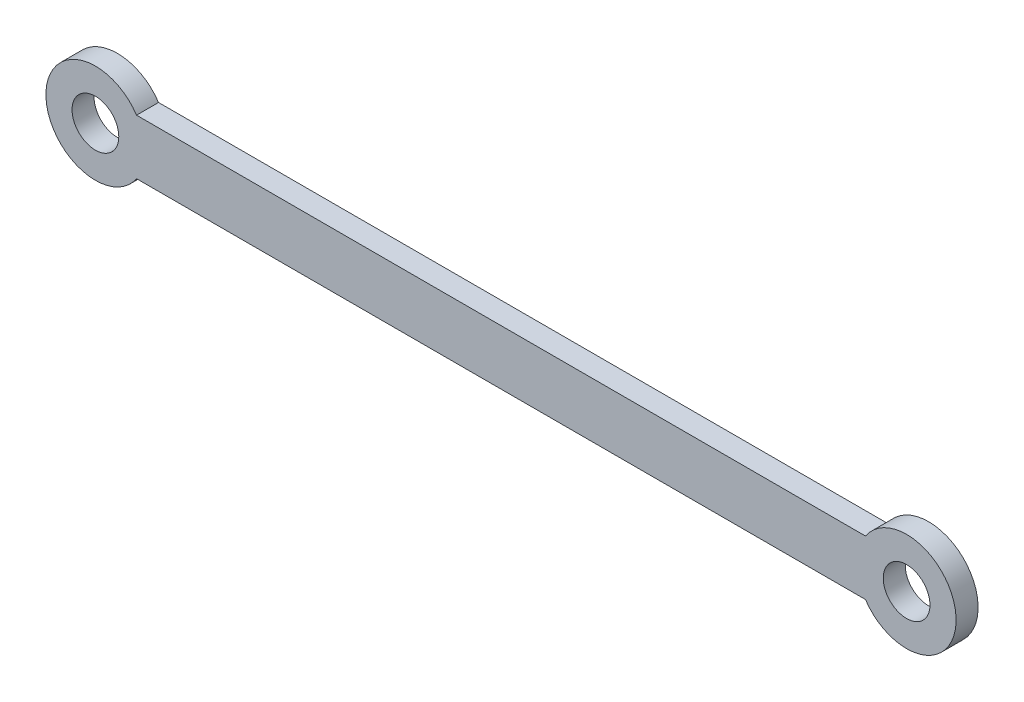
ISO-10303-21;
HEADER;
FILE_DESCRIPTION(('STEP AP214'),'2;1');
FILE_NAME('part.step','',(''),(''),'','','');
FILE_SCHEMA(('AUTOMOTIVE_DESIGN { 1 0 10303 214 1 1 1 1 }'));
ENDSEC;
DATA;
#1=APPLICATION_CONTEXT('core data for automotive mechanical design processes');
#2=APPLICATION_PROTOCOL_DEFINITION('international standard','automotive_design',2000,#1);
#3=PRODUCT_CONTEXT('',#1,'mechanical');
#4=PRODUCT('Part','Part','',(#3));
#5=PRODUCT_RELATED_PRODUCT_CATEGORY('part','',(#4));
#6=PRODUCT_DEFINITION_FORMATION('','',#4);
#7=PRODUCT_DEFINITION_CONTEXT('part definition',#1,'design');
#8=PRODUCT_DEFINITION('design','',#6,#7);
#9=PRODUCT_DEFINITION_SHAPE('','',#8);
#10=(LENGTH_UNIT() NAMED_UNIT(*) SI_UNIT(.MILLI.,.METRE.));
#11=(NAMED_UNIT(*) PLANE_ANGLE_UNIT() SI_UNIT($,.RADIAN.));
#12=(NAMED_UNIT(*) SI_UNIT($,.STERADIAN.) SOLID_ANGLE_UNIT());
#13=UNCERTAINTY_MEASURE_WITH_UNIT(LENGTH_MEASURE(1.E-05),#10,'distance_accuracy_value','');
#14=(GEOMETRIC_REPRESENTATION_CONTEXT(3) GLOBAL_UNCERTAINTY_ASSIGNED_CONTEXT((#13)) GLOBAL_UNIT_ASSIGNED_CONTEXT((#10,
#11,#12)) REPRESENTATION_CONTEXT('',''));
#15=CARTESIAN_POINT('',(0.,0.,0.));
#16=DIRECTION('',(0.,0.,1.));
#17=DIRECTION('',(1.,0.,0.));
#18=AXIS2_PLACEMENT_3D('',#15,#16,#17);
#19=CARTESIAN_POINT('',(0.,0.,4.));
#20=DIRECTION('',(0.,0.,1.));
#21=DIRECTION('',(1.,0.,0.));
#22=AXIS2_PLACEMENT_3D('',#19,#20,#21);
#23=PLANE('',#22);
#24=CARTESIAN_POINT('',(0.,0.,4.));
#25=DIRECTION('',(0.,0.,1.));
#26=DIRECTION('',(1.,0.,0.));
#27=AXIS2_PLACEMENT_3D('',#24,#25,#26);
#28=CIRCLE('',#27,4.25);
#29=CARTESIAN_POINT('',(4.25,0.,4.));
#30=VERTEX_POINT('',#29);
#31=EDGE_CURVE('E101',#30,#30,#28,.T.);
#32=ORIENTED_EDGE('',*,*,#31,.F.);
#33=EDGE_LOOP('',(#32));
#34=FACE_BOUND('',#33,.T.);
#35=CARTESIAN_POINT('',(0.,0.,4.));
#36=DIRECTION('',(0.,0.,1.));
#37=DIRECTION('',(1.,0.,0.));
#38=AXIS2_PLACEMENT_3D('',#35,#36,#37);
#39=CIRCLE('',#38,9.);
#40=CARTESIAN_POINT('',(7.48331477354788,5.,4.));
#41=VERTEX_POINT('',#40);
#42=CARTESIAN_POINT('',(7.48331477354788,-5.,4.));
#43=VERTEX_POINT('',#42);
#44=EDGE_CURVE('E86',#41,#43,#39,.T.);
#45=ORIENTED_EDGE('',*,*,#44,.T.);
#46=DIRECTION('',(1.,0.,0.));
#47=VECTOR('',#46,1.);
#48=CARTESIAN_POINT('',(7.48331477354788,-5.,4.));
#49=LINE('',#48,#47);
#50=CARTESIAN_POINT('',(140.016685226452,-5.,4.));
#51=VERTEX_POINT('',#50);
#52=EDGE_CURVE('E81',#43,#51,#49,.T.);
#53=ORIENTED_EDGE('',*,*,#52,.T.);
#54=CARTESIAN_POINT('',(147.5,0.,4.));
#55=DIRECTION('',(0.,0.,1.));
#56=DIRECTION('',(1.,0.,0.));
#57=AXIS2_PLACEMENT_3D('',#54,#55,#56);
#58=CIRCLE('',#57,9.);
#59=CARTESIAN_POINT('',(140.016685226452,5.,4.));
#60=VERTEX_POINT('',#59);
#61=EDGE_CURVE('E84',#51,#60,#58,.T.);
#62=ORIENTED_EDGE('',*,*,#61,.T.);
#63=DIRECTION('',(-1.,0.,0.));
#64=VECTOR('',#63,1.);
#65=CARTESIAN_POINT('',(7.48331477354788,5.,4.));
#66=LINE('',#65,#64);
#67=EDGE_CURVE('E51',#60,#41,#66,.T.);
#68=ORIENTED_EDGE('',*,*,#67,.T.);
#69=EDGE_LOOP('',(#45,#53,#62,#68));
#70=FACE_BOUND('',#69,.T.);
#71=CARTESIAN_POINT('',(147.5,0.,4.));
#72=DIRECTION('',(0.,0.,1.));
#73=DIRECTION('',(1.,0.,0.));
#74=AXIS2_PLACEMENT_3D('',#71,#72,#73);
#75=CIRCLE('',#74,4.25000000000001);
#76=CARTESIAN_POINT('',(151.75,0.,4.));
#77=VERTEX_POINT('',#76);
#78=EDGE_CURVE('E116',#77,#77,#75,.T.);
#79=ORIENTED_EDGE('',*,*,#78,.F.);
#80=EDGE_LOOP('',(#79));
#81=FACE_BOUND('',#80,.T.);
#82=ADVANCED_FACE('F34',(#34,#70,#81),#23,.T.);
#83=CARTESIAN_POINT('',(0.,0.,0.));
#84=DIRECTION('',(0.,0.,1.));
#85=DIRECTION('',(1.,0.,0.));
#86=AXIS2_PLACEMENT_3D('',#83,#84,#85);
#87=PLANE('',#86);
#88=CARTESIAN_POINT('',(0.,0.,0.));
#89=DIRECTION('',(0.,0.,1.));
#90=DIRECTION('',(1.,0.,0.));
#91=AXIS2_PLACEMENT_3D('',#88,#89,#90);
#92=CIRCLE('',#91,9.);
#93=CARTESIAN_POINT('',(7.48331477354788,5.,0.));
#94=VERTEX_POINT('',#93);
#95=CARTESIAN_POINT('',(7.48331477354788,-5.,0.));
#96=VERTEX_POINT('',#95);
#97=EDGE_CURVE('E98',#94,#96,#92,.T.);
#98=ORIENTED_EDGE('',*,*,#97,.F.);
#99=DIRECTION('',(-1.,0.,0.));
#100=VECTOR('',#99,1.);
#101=CARTESIAN_POINT('',(7.48331477354788,5.,0.));
#102=LINE('',#101,#100);
#103=CARTESIAN_POINT('',(140.016685226452,5.,0.));
#104=VERTEX_POINT('',#103);
#105=EDGE_CURVE('E74',#104,#94,#102,.T.);
#106=ORIENTED_EDGE('',*,*,#105,.F.);
#107=CARTESIAN_POINT('',(147.5,0.,0.));
#108=DIRECTION('',(0.,0.,1.));
#109=DIRECTION('',(1.,0.,0.));
#110=AXIS2_PLACEMENT_3D('',#107,#108,#109);
#111=CIRCLE('',#110,9.);
#112=CARTESIAN_POINT('',(140.016685226452,-5.,0.));
#113=VERTEX_POINT('',#112);
#114=EDGE_CURVE('E68',#113,#104,#111,.T.);
#115=ORIENTED_EDGE('',*,*,#114,.F.);
#116=DIRECTION('',(1.,0.,0.));
#117=VECTOR('',#116,1.);
#118=CARTESIAN_POINT('',(7.48331477354788,-5.,0.));
#119=LINE('',#118,#117);
#120=EDGE_CURVE('E90',#96,#113,#119,.T.);
#121=ORIENTED_EDGE('',*,*,#120,.F.);
#122=EDGE_LOOP('',(#98,#106,#115,#121));
#123=FACE_BOUND('',#122,.T.);
#124=CARTESIAN_POINT('',(0.,0.,0.));
#125=DIRECTION('',(0.,0.,1.));
#126=DIRECTION('',(1.,0.,0.));
#127=AXIS2_PLACEMENT_3D('',#124,#125,#126);
#128=CIRCLE('',#127,4.25);
#129=CARTESIAN_POINT('',(4.25,0.,0.));
#130=VERTEX_POINT('',#129);
#131=EDGE_CURVE('E113',#130,#130,#128,.T.);
#132=ORIENTED_EDGE('',*,*,#131,.T.);
#133=EDGE_LOOP('',(#132));
#134=FACE_BOUND('',#133,.T.);
#135=CARTESIAN_POINT('',(147.5,0.,0.));
#136=DIRECTION('',(0.,0.,1.));
#137=DIRECTION('',(1.,0.,0.));
#138=AXIS2_PLACEMENT_3D('',#135,#136,#137);
#139=CIRCLE('',#138,4.25000000000001);
#140=CARTESIAN_POINT('',(151.75,0.,0.));
#141=VERTEX_POINT('',#140);
#142=EDGE_CURVE('E119',#141,#141,#139,.T.);
#143=ORIENTED_EDGE('',*,*,#142,.T.);
#144=EDGE_LOOP('',(#143));
#145=FACE_BOUND('',#144,.T.);
#146=ADVANCED_FACE('F109',(#123,#134,#145),#87,.F.);
#147=CARTESIAN_POINT('',(0.,0.,4.));
#148=DIRECTION('',(0.,0.,-1.));
#149=DIRECTION('',(-1.,0.,0.));
#150=AXIS2_PLACEMENT_3D('',#147,#148,#149);
#151=CYLINDRICAL_SURFACE('',#150,9.);
#152=ORIENTED_EDGE('',*,*,#97,.T.);
#153=DIRECTION('',(0.,0.,-1.));
#154=VECTOR('',#153,1.);
#155=CARTESIAN_POINT('',(7.48331477354788,-5.,4.));
#156=LINE('',#155,#154);
#157=EDGE_CURVE('E11',#43,#96,#156,.T.);
#158=ORIENTED_EDGE('',*,*,#157,.F.);
#159=ORIENTED_EDGE('',*,*,#44,.F.);
#160=DIRECTION('',(0.,0.,-1.));
#161=VECTOR('',#160,1.);
#162=CARTESIAN_POINT('',(7.48331477354788,5.,4.));
#163=LINE('',#162,#161);
#164=EDGE_CURVE('E94',#41,#94,#163,.T.);
#165=ORIENTED_EDGE('',*,*,#164,.T.);
#166=EDGE_LOOP('',(#152,#158,#159,#165));
#167=FACE_BOUND('',#166,.T.);
#168=ADVANCED_FACE('F36',(#167),#151,.T.);
#169=CARTESIAN_POINT('',(7.48331477354788,-5.,4.));
#170=DIRECTION('',(0.,1.,0.));
#171=DIRECTION('',(0.,0.,1.));
#172=AXIS2_PLACEMENT_3D('',#169,#170,#171);
#173=PLANE('',#172);
#174=ORIENTED_EDGE('',*,*,#120,.T.);
#175=DIRECTION('',(0.,0.,-1.));
#176=VECTOR('',#175,1.);
#177=CARTESIAN_POINT('',(140.016685226452,-5.,4.));
#178=LINE('',#177,#176);
#179=EDGE_CURVE('E43',#51,#113,#178,.T.);
#180=ORIENTED_EDGE('',*,*,#179,.F.);
#181=ORIENTED_EDGE('',*,*,#52,.F.);
#182=ORIENTED_EDGE('',*,*,#157,.T.);
#183=EDGE_LOOP('',(#174,#180,#181,#182));
#184=FACE_BOUND('',#183,.T.);
#185=ADVANCED_FACE('F89',(#184),#173,.F.);
#186=CARTESIAN_POINT('',(147.5,0.,4.));
#187=DIRECTION('',(0.,0.,-1.));
#188=DIRECTION('',(-1.,0.,0.));
#189=AXIS2_PLACEMENT_3D('',#186,#187,#188);
#190=CYLINDRICAL_SURFACE('',#189,9.);
#191=ORIENTED_EDGE('',*,*,#114,.T.);
#192=DIRECTION('',(0.,0.,-1.));
#193=VECTOR('',#192,1.);
#194=CARTESIAN_POINT('',(140.016685226452,5.,4.));
#195=LINE('',#194,#193);
#196=EDGE_CURVE('E91',#60,#104,#195,.T.);
#197=ORIENTED_EDGE('',*,*,#196,.F.);
#198=ORIENTED_EDGE('',*,*,#61,.F.);
#199=ORIENTED_EDGE('',*,*,#179,.T.);
#200=EDGE_LOOP('',(#191,#197,#198,#199));
#201=FACE_BOUND('',#200,.T.);
#202=ADVANCED_FACE('F92',(#201),#190,.T.);
#203=CARTESIAN_POINT('',(7.48331477354788,5.,4.));
#204=DIRECTION('',(0.,-1.,0.));
#205=DIRECTION('',(0.,0.,-1.));
#206=AXIS2_PLACEMENT_3D('',#203,#204,#205);
#207=PLANE('',#206);
#208=ORIENTED_EDGE('',*,*,#105,.T.);
#209=ORIENTED_EDGE('',*,*,#164,.F.);
#210=ORIENTED_EDGE('',*,*,#67,.F.);
#211=ORIENTED_EDGE('',*,*,#196,.T.);
#212=EDGE_LOOP('',(#208,#209,#210,#211));
#213=FACE_BOUND('',#212,.T.);
#214=ADVANCED_FACE('F106',(#213),#207,.F.);
#215=CARTESIAN_POINT('',(0.,0.,4.));
#216=DIRECTION('',(0.,0.,-1.));
#217=DIRECTION('',(-1.,0.,0.));
#218=AXIS2_PLACEMENT_3D('',#215,#216,#217);
#219=CYLINDRICAL_SURFACE('',#218,4.25);
#220=ORIENTED_EDGE('',*,*,#31,.T.);
#221=EDGE_LOOP('',(#220));
#222=FACE_BOUND('',#221,.T.);
#223=ORIENTED_EDGE('',*,*,#131,.F.);
#224=EDGE_LOOP('',(#223));
#225=FACE_BOUND('',#224,.T.);
#226=ADVANCED_FACE('F136',(#222,#225),#219,.F.);
#227=CARTESIAN_POINT('',(147.5,0.,4.));
#228=DIRECTION('',(0.,0.,-1.));
#229=DIRECTION('',(-1.,0.,0.));
#230=AXIS2_PLACEMENT_3D('',#227,#228,#229);
#231=CYLINDRICAL_SURFACE('',#230,4.25000000000001);
#232=ORIENTED_EDGE('',*,*,#78,.T.);
#233=EDGE_LOOP('',(#232));
#234=FACE_BOUND('',#233,.T.);
#235=ORIENTED_EDGE('',*,*,#142,.F.);
#236=EDGE_LOOP('',(#235));
#237=FACE_BOUND('',#236,.T.);
#238=ADVANCED_FACE('F125',(#234,#237),#231,.F.);
#239=CLOSED_SHELL('',(#82,#146,#168,#185,#202,#214,#226,#238));
#240=MANIFOLD_SOLID_BREP('B2',#239);
#241=ADVANCED_BREP_SHAPE_REPRESENTATION('',(#18,#240),#14);
#242=SHAPE_DEFINITION_REPRESENTATION(#9,#241);
ENDSEC;
END-ISO-10303-21;
